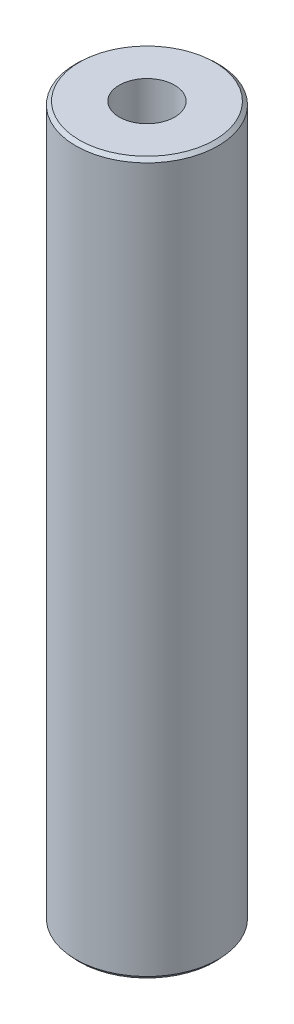
ISO-10303-21;
HEADER;
FILE_DESCRIPTION(('STEP AP214'),'2;1');
FILE_NAME('part.step','',(''),(''),'','','');
FILE_SCHEMA(('AUTOMOTIVE_DESIGN { 1 0 10303 214 1 1 1 1 }'));
ENDSEC;
DATA;
#1=APPLICATION_CONTEXT('core data for automotive mechanical design processes');
#2=APPLICATION_PROTOCOL_DEFINITION('international standard','automotive_design',2000,#1);
#3=PRODUCT_CONTEXT('',#1,'mechanical');
#4=PRODUCT('Part','Part','',(#3));
#5=PRODUCT_RELATED_PRODUCT_CATEGORY('part','',(#4));
#6=PRODUCT_DEFINITION_FORMATION('','',#4);
#7=PRODUCT_DEFINITION_CONTEXT('part definition',#1,'design');
#8=PRODUCT_DEFINITION('design','',#6,#7);
#9=PRODUCT_DEFINITION_SHAPE('','',#8);
#10=(LENGTH_UNIT() NAMED_UNIT(*) SI_UNIT(.MILLI.,.METRE.));
#11=(NAMED_UNIT(*) PLANE_ANGLE_UNIT() SI_UNIT($,.RADIAN.));
#12=(NAMED_UNIT(*) SI_UNIT($,.STERADIAN.) SOLID_ANGLE_UNIT());
#13=UNCERTAINTY_MEASURE_WITH_UNIT(LENGTH_MEASURE(1.E-05),#10,'distance_accuracy_value','');
#14=(GEOMETRIC_REPRESENTATION_CONTEXT(3) GLOBAL_UNCERTAINTY_ASSIGNED_CONTEXT((#13)) GLOBAL_UNIT_ASSIGNED_CONTEXT((#10,
#11,#12)) REPRESENTATION_CONTEXT('',''));
#15=CARTESIAN_POINT('',(0.,0.,0.));
#16=DIRECTION('',(0.,0.,1.));
#17=DIRECTION('',(1.,0.,0.));
#18=AXIS2_PLACEMENT_3D('',#15,#16,#17);
#19=CARTESIAN_POINT('',(0.,600.,0.));
#20=DIRECTION('',(0.,-1.,0.));
#21=DIRECTION('',(0.,0.,-1.));
#22=AXIS2_PLACEMENT_3D('',#19,#20,#21);
#23=CYLINDRICAL_SURFACE('',#22,60.);
#24=CARTESIAN_POINT('',(0.,597.283324018564,0.));
#25=DIRECTION('',(0.,1.,0.));
#26=DIRECTION('',(0.,0.,1.));
#27=AXIS2_PLACEMENT_3D('',#24,#25,#26);
#28=CIRCLE('',#27,60.);
#29=CARTESIAN_POINT('',(0.,597.283324018564,60.));
#30=VERTEX_POINT('',#29);
#31=EDGE_CURVE('E50',#30,#30,#28,.F.);
#32=ORIENTED_EDGE('',*,*,#31,.T.);
#33=EDGE_LOOP('',(#32));
#34=FACE_BOUND('',#33,.T.);
#35=CARTESIAN_POINT('',(0.,3.04836230799643,0.));
#36=DIRECTION('',(0.,1.,0.));
#37=DIRECTION('',(0.,0.,1.));
#38=AXIS2_PLACEMENT_3D('',#35,#36,#37);
#39=CIRCLE('',#38,60.);
#40=CARTESIAN_POINT('',(0.,3.04836230799643,60.));
#41=VERTEX_POINT('',#40);
#42=EDGE_CURVE('E51',#41,#41,#39,.T.);
#43=ORIENTED_EDGE('',*,*,#42,.T.);
#44=EDGE_LOOP('',(#43));
#45=FACE_BOUND('',#44,.T.);
#46=ADVANCED_FACE('F39',(#34,#45),#23,.T.);
#47=CARTESIAN_POINT('',(0.,600.,0.));
#48=DIRECTION('',(0.,1.,0.));
#49=DIRECTION('',(0.,0.,1.));
#50=AXIS2_PLACEMENT_3D('',#47,#48,#49);
#51=PLANE('',#50);
#52=CARTESIAN_POINT('',(0.,600.,0.));
#53=DIRECTION('',(0.,1.,0.));
#54=DIRECTION('',(0.,0.,1.));
#55=AXIS2_PLACEMENT_3D('',#52,#53,#54);
#56=CIRCLE('',#55,56.9516376920036);
#57=CARTESIAN_POINT('',(0.,600.,56.9516376920036));
#58=VERTEX_POINT('',#57);
#59=EDGE_CURVE('E54',#58,#58,#56,.T.);
#60=ORIENTED_EDGE('',*,*,#59,.T.);
#61=EDGE_LOOP('',(#60));
#62=FACE_BOUND('',#61,.T.);
#63=CARTESIAN_POINT('',(0.,600.,0.));
#64=DIRECTION('',(0.,1.,0.));
#65=DIRECTION('',(0.,0.,1.));
#66=AXIS2_PLACEMENT_3D('',#63,#64,#65);
#67=CIRCLE('',#66,23.3641484176925);
#68=CARTESIAN_POINT('',(0.,600.,23.3641484176925));
#69=VERTEX_POINT('',#68);
#70=EDGE_CURVE('E58',#69,#69,#67,.T.);
#71=ORIENTED_EDGE('',*,*,#70,.F.);
#72=EDGE_LOOP('',(#71));
#73=FACE_BOUND('',#72,.T.);
#74=ADVANCED_FACE('F69',(#62,#73),#51,.T.);
#75=CARTESIAN_POINT('',(0.,0.,0.));
#76=DIRECTION('',(0.,1.,0.));
#77=DIRECTION('',(0.,0.,1.));
#78=AXIS2_PLACEMENT_3D('',#75,#76,#77);
#79=PLANE('',#78);
#80=CARTESIAN_POINT('',(0.,0.,0.));
#81=DIRECTION('',(0.,1.,0.));
#82=DIRECTION('',(0.,0.,1.));
#83=AXIS2_PLACEMENT_3D('',#80,#81,#82);
#84=CIRCLE('',#83,57.2833240185643);
#85=CARTESIAN_POINT('',(0.,0.,57.2833240185643));
#86=VERTEX_POINT('',#85);
#87=EDGE_CURVE('E10',#86,#86,#84,.F.);
#88=ORIENTED_EDGE('',*,*,#87,.T.);
#89=EDGE_LOOP('',(#88));
#90=FACE_BOUND('',#89,.T.);
#91=CARTESIAN_POINT('',(0.,0.,0.));
#92=DIRECTION('',(0.,1.,0.));
#93=DIRECTION('',(0.,0.,1.));
#94=AXIS2_PLACEMENT_3D('',#91,#92,#93);
#95=CIRCLE('',#94,23.3641484176925);
#96=CARTESIAN_POINT('',(0.,0.,23.3641484176925));
#97=VERTEX_POINT('',#96);
#98=EDGE_CURVE('E63',#97,#97,#95,.T.);
#99=ORIENTED_EDGE('',*,*,#98,.T.);
#100=EDGE_LOOP('',(#99));
#101=FACE_BOUND('',#100,.T.);
#102=ADVANCED_FACE('F75',(#90,#101),#79,.F.);
#103=CARTESIAN_POINT('',(0.,600.,0.));
#104=DIRECTION('',(0.,-1.,0.));
#105=DIRECTION('',(0.,0.,-1.));
#106=AXIS2_PLACEMENT_3D('',#103,#104,#105);
#107=CYLINDRICAL_SURFACE('',#106,23.3641484176925);
#108=ORIENTED_EDGE('',*,*,#70,.T.);
#109=EDGE_LOOP('',(#108));
#110=FACE_BOUND('',#109,.T.);
#111=ORIENTED_EDGE('',*,*,#98,.F.);
#112=EDGE_LOOP('',(#111));
#113=FACE_BOUND('',#112,.T.);
#114=ADVANCED_FACE('F70',(#110,#113),#107,.F.);
#115=CARTESIAN_POINT('',(0.,600.,0.));
#116=DIRECTION('',(0.,-1.,0.));
#117=DIRECTION('',(0.,0.,-1.));
#118=AXIS2_PLACEMENT_3D('',#115,#116,#117);
#119=CONICAL_SURFACE('',#118,56.9516376920036,0.842868912997769);
#120=ORIENTED_EDGE('',*,*,#31,.F.);
#121=EDGE_LOOP('',(#120));
#122=FACE_BOUND('',#121,.T.);
#123=ORIENTED_EDGE('',*,*,#59,.F.);
#124=EDGE_LOOP('',(#123));
#125=FACE_BOUND('',#124,.T.);
#126=ADVANCED_FACE('F81',(#122,#125),#119,.T.);
#127=CARTESIAN_POINT('',(0.,3.04836230799643,0.));
#128=DIRECTION('',(0.,1.,0.));
#129=DIRECTION('',(0.,0.,1.));
#130=AXIS2_PLACEMENT_3D('',#127,#128,#129);
#131=CONICAL_SURFACE('',#130,60.,0.72792741379713);
#132=ORIENTED_EDGE('',*,*,#87,.F.);
#133=EDGE_LOOP('',(#132));
#134=FACE_BOUND('',#133,.T.);
#135=ORIENTED_EDGE('',*,*,#42,.F.);
#136=EDGE_LOOP('',(#135));
#137=FACE_BOUND('',#136,.T.);
#138=ADVANCED_FACE('F45',(#134,#137),#131,.T.);
#139=CLOSED_SHELL('',(#46,#74,#102,#114,#126,#138));
#140=MANIFOLD_SOLID_BREP('B2',#139);
#141=ADVANCED_BREP_SHAPE_REPRESENTATION('',(#18,#140),#14);
#142=SHAPE_DEFINITION_REPRESENTATION(#9,#141);
ENDSEC;
END-ISO-10303-21;
